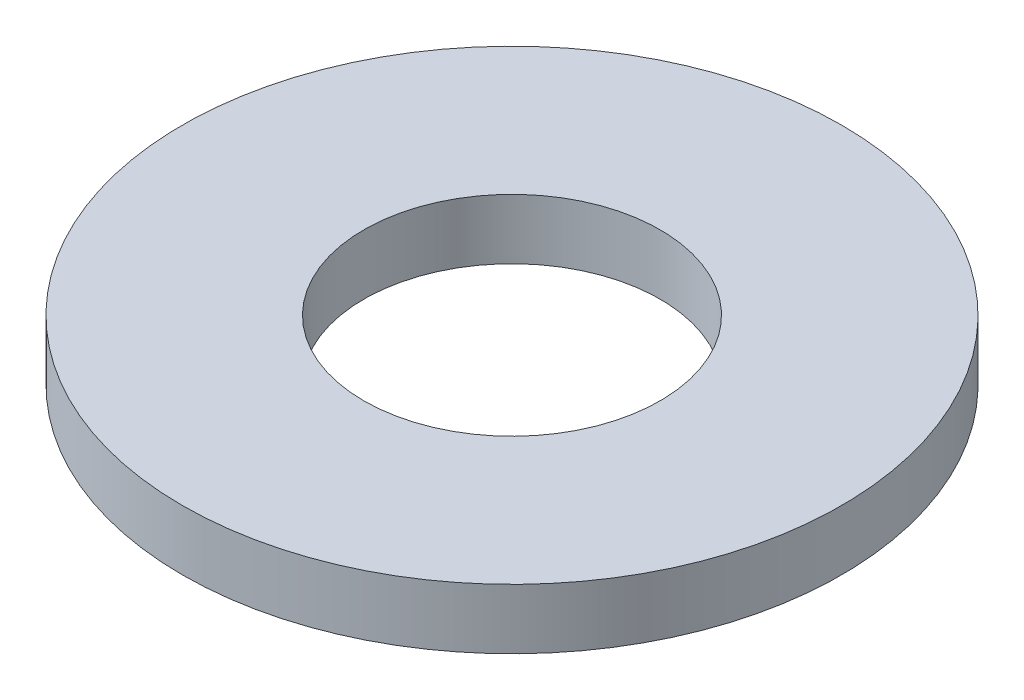
ISO-10303-21;
HEADER;
FILE_DESCRIPTION(('STEP AP214'),'2;1');
FILE_NAME('part.step','',(''),(''),'','','');
FILE_SCHEMA(('AUTOMOTIVE_DESIGN { 1 0 10303 214 1 1 1 1 }'));
ENDSEC;
DATA;
#1=APPLICATION_CONTEXT('core data for automotive mechanical design processes');
#2=APPLICATION_PROTOCOL_DEFINITION('international standard','automotive_design',2000,#1);
#3=PRODUCT_CONTEXT('',#1,'mechanical');
#4=PRODUCT('Part','Part','',(#3));
#5=PRODUCT_RELATED_PRODUCT_CATEGORY('part','',(#4));
#6=PRODUCT_DEFINITION_FORMATION('','',#4);
#7=PRODUCT_DEFINITION_CONTEXT('part definition',#1,'design');
#8=PRODUCT_DEFINITION('design','',#6,#7);
#9=PRODUCT_DEFINITION_SHAPE('','',#8);
#10=(LENGTH_UNIT() NAMED_UNIT(*) SI_UNIT(.MILLI.,.METRE.));
#11=(NAMED_UNIT(*) PLANE_ANGLE_UNIT() SI_UNIT($,.RADIAN.));
#12=(NAMED_UNIT(*) SI_UNIT($,.STERADIAN.) SOLID_ANGLE_UNIT());
#13=UNCERTAINTY_MEASURE_WITH_UNIT(LENGTH_MEASURE(1.E-05),#10,'distance_accuracy_value','');
#14=(GEOMETRIC_REPRESENTATION_CONTEXT(3) GLOBAL_UNCERTAINTY_ASSIGNED_CONTEXT((#13)) GLOBAL_UNIT_ASSIGNED_CONTEXT((#10,
#11,#12)) REPRESENTATION_CONTEXT('',''));
#15=CARTESIAN_POINT('',(0.,0.,0.));
#16=DIRECTION('',(0.,0.,1.));
#17=DIRECTION('',(1.,0.,0.));
#18=AXIS2_PLACEMENT_3D('',#15,#16,#17);
#19=CARTESIAN_POINT('',(0.,1.4478,0.));
#20=DIRECTION('',(0.,-1.,0.));
#21=DIRECTION('',(0.,0.,-1.));
#22=AXIS2_PLACEMENT_3D('',#19,#20,#21);
#23=CYLINDRICAL_SURFACE('',#22,7.9375);
#24=CARTESIAN_POINT('',(0.,1.4478,0.));
#25=DIRECTION('',(0.,1.,0.));
#26=DIRECTION('',(0.,0.,1.));
#27=AXIS2_PLACEMENT_3D('',#24,#25,#26);
#28=CIRCLE('',#27,7.9375);
#29=CARTESIAN_POINT('',(0.,1.4478,7.9375));
#30=VERTEX_POINT('',#29);
#31=EDGE_CURVE('E10',#30,#30,#28,.T.);
#32=ORIENTED_EDGE('',*,*,#31,.F.);
#33=EDGE_LOOP('',(#32));
#34=FACE_BOUND('',#33,.T.);
#35=CARTESIAN_POINT('',(0.,0.,0.));
#36=DIRECTION('',(0.,1.,0.));
#37=DIRECTION('',(0.,0.,1.));
#38=AXIS2_PLACEMENT_3D('',#35,#36,#37);
#39=CIRCLE('',#38,7.9375);
#40=CARTESIAN_POINT('',(0.,0.,7.9375));
#41=VERTEX_POINT('',#40);
#42=EDGE_CURVE('E35',#41,#41,#39,.T.);
#43=ORIENTED_EDGE('',*,*,#42,.T.);
#44=EDGE_LOOP('',(#43));
#45=FACE_BOUND('',#44,.T.);
#46=ADVANCED_FACE('F32',(#34,#45),#23,.T.);
#47=CARTESIAN_POINT('',(0.,1.4478,0.));
#48=DIRECTION('',(0.,1.,0.));
#49=DIRECTION('',(0.,0.,1.));
#50=AXIS2_PLACEMENT_3D('',#47,#48,#49);
#51=PLANE('',#50);
#52=CARTESIAN_POINT('',(0.,1.4478,0.));
#53=DIRECTION('',(0.,1.,0.));
#54=DIRECTION('',(0.,0.,1.));
#55=AXIS2_PLACEMENT_3D('',#52,#53,#54);
#56=CIRCLE('',#55,3.5687);
#57=CARTESIAN_POINT('',(0.,1.4478,3.5687));
#58=VERTEX_POINT('',#57);
#59=EDGE_CURVE('E44',#58,#58,#56,.T.);
#60=ORIENTED_EDGE('',*,*,#59,.F.);
#61=EDGE_LOOP('',(#60));
#62=FACE_BOUND('',#61,.T.);
#63=ORIENTED_EDGE('',*,*,#31,.T.);
#64=EDGE_LOOP('',(#63));
#65=FACE_BOUND('',#64,.T.);
#66=ADVANCED_FACE('F59',(#62,#65),#51,.T.);
#67=CARTESIAN_POINT('',(0.,0.,0.));
#68=DIRECTION('',(0.,1.,0.));
#69=DIRECTION('',(0.,0.,1.));
#70=AXIS2_PLACEMENT_3D('',#67,#68,#69);
#71=PLANE('',#70);
#72=CARTESIAN_POINT('',(0.,0.,0.));
#73=DIRECTION('',(0.,1.,0.));
#74=DIRECTION('',(0.,0.,1.));
#75=AXIS2_PLACEMENT_3D('',#72,#73,#74);
#76=CIRCLE('',#75,3.5687);
#77=CARTESIAN_POINT('',(0.,0.,3.5687));
#78=VERTEX_POINT('',#77);
#79=EDGE_CURVE('E42',#78,#78,#76,.T.);
#80=ORIENTED_EDGE('',*,*,#79,.T.);
#81=EDGE_LOOP('',(#80));
#82=FACE_BOUND('',#81,.T.);
#83=ORIENTED_EDGE('',*,*,#42,.F.);
#84=EDGE_LOOP('',(#83));
#85=FACE_BOUND('',#84,.T.);
#86=ADVANCED_FACE('F50',(#82,#85),#71,.F.);
#87=CARTESIAN_POINT('',(0.,0.,0.));
#88=DIRECTION('',(0.,1.,0.));
#89=DIRECTION('',(0.,0.,1.));
#90=AXIS2_PLACEMENT_3D('',#87,#88,#89);
#91=CYLINDRICAL_SURFACE('',#90,3.5687);
#92=ORIENTED_EDGE('',*,*,#79,.F.);
#93=EDGE_LOOP('',(#92));
#94=FACE_BOUND('',#93,.T.);
#95=ORIENTED_EDGE('',*,*,#59,.T.);
#96=EDGE_LOOP('',(#95));
#97=FACE_BOUND('',#96,.T.);
#98=ADVANCED_FACE('F53',(#94,#97),#91,.F.);
#99=CLOSED_SHELL('',(#46,#66,#86,#98));
#100=MANIFOLD_SOLID_BREP('B2',#99);
#101=ADVANCED_BREP_SHAPE_REPRESENTATION('',(#18,#100),#14);
#102=SHAPE_DEFINITION_REPRESENTATION(#9,#101);
ENDSEC;
END-ISO-10303-21;
